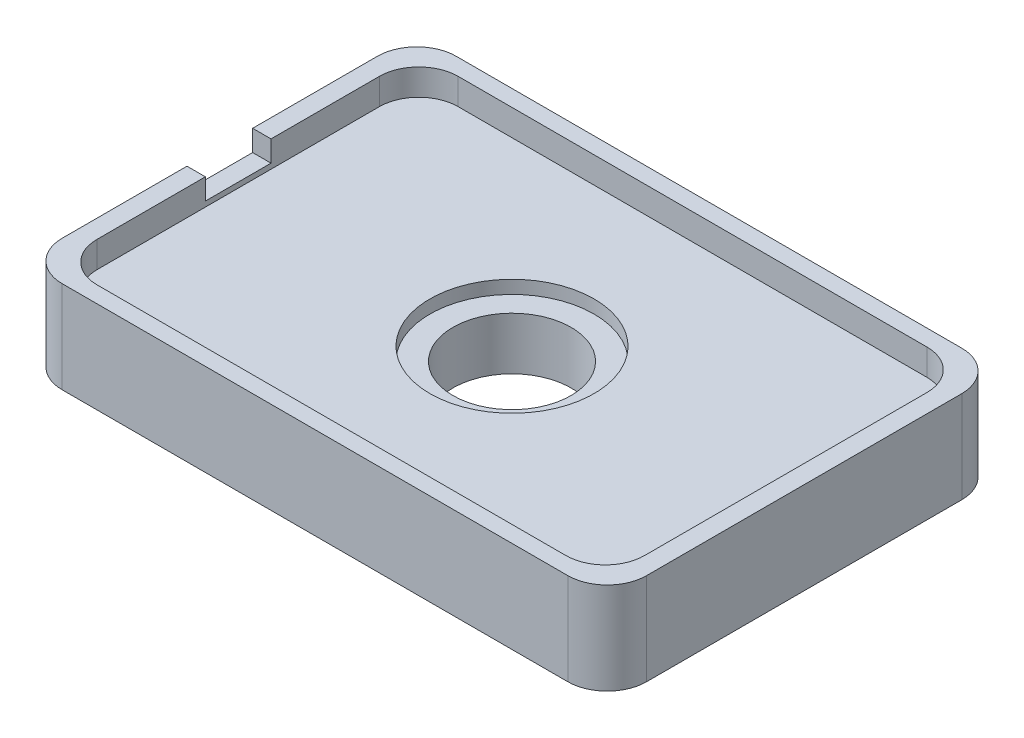
ISO-10303-21;
HEADER;
FILE_DESCRIPTION(('STEP AP214'),'2;1');
FILE_NAME('part.step','',(''),(''),'','','');
FILE_SCHEMA(('AUTOMOTIVE_DESIGN { 1 0 10303 214 1 1 1 1 }'));
ENDSEC;
DATA;
#1=APPLICATION_CONTEXT('core data for automotive mechanical design processes');
#2=APPLICATION_PROTOCOL_DEFINITION('international standard','automotive_design',2000,#1);
#3=PRODUCT_CONTEXT('',#1,'mechanical');
#4=PRODUCT('Part','Part','',(#3));
#5=PRODUCT_RELATED_PRODUCT_CATEGORY('part','',(#4));
#6=PRODUCT_DEFINITION_FORMATION('','',#4);
#7=PRODUCT_DEFINITION_CONTEXT('part definition',#1,'design');
#8=PRODUCT_DEFINITION('design','',#6,#7);
#9=PRODUCT_DEFINITION_SHAPE('','',#8);
#10=(LENGTH_UNIT() NAMED_UNIT(*) SI_UNIT(.MILLI.,.METRE.));
#11=(NAMED_UNIT(*) PLANE_ANGLE_UNIT() SI_UNIT($,.RADIAN.));
#12=(NAMED_UNIT(*) SI_UNIT($,.STERADIAN.) SOLID_ANGLE_UNIT());
#13=UNCERTAINTY_MEASURE_WITH_UNIT(LENGTH_MEASURE(1.E-05),#10,'distance_accuracy_value','');
#14=(GEOMETRIC_REPRESENTATION_CONTEXT(3) GLOBAL_UNCERTAINTY_ASSIGNED_CONTEXT((#13)) GLOBAL_UNIT_ASSIGNED_CONTEXT((#10,
#11,#12)) REPRESENTATION_CONTEXT('',''));
#15=CARTESIAN_POINT('',(0.,0.,0.));
#16=DIRECTION('',(0.,0.,1.));
#17=DIRECTION('',(1.,0.,0.));
#18=AXIS2_PLACEMENT_3D('',#15,#16,#17);
#19=CARTESIAN_POINT('',(0.,-5.001,0.));
#20=DIRECTION('',(0.,1.,0.));
#21=DIRECTION('',(0.,0.,1.));
#22=AXIS2_PLACEMENT_3D('',#19,#20,#21);
#23=CYLINDRICAL_SURFACE('',#22,4.5);
#24=CARTESIAN_POINT('',(0.,-5.,0.));
#25=DIRECTION('',(0.,1.,0.));
#26=DIRECTION('',(0.,0.,1.));
#27=AXIS2_PLACEMENT_3D('',#24,#25,#26);
#28=CIRCLE('',#27,4.5);
#29=CARTESIAN_POINT('',(0.,-5.,4.5));
#30=VERTEX_POINT('',#29);
#31=EDGE_CURVE('E244',#30,#30,#28,.F.);
#32=ORIENTED_EDGE('',*,*,#31,.T.);
#33=EDGE_LOOP('',(#32));
#34=FACE_BOUND('',#33,.T.);
#35=CARTESIAN_POINT('',(0.,-1.,0.));
#36=DIRECTION('',(0.,1.,0.));
#37=DIRECTION('',(0.,0.,1.));
#38=AXIS2_PLACEMENT_3D('',#35,#36,#37);
#39=CIRCLE('',#38,4.5);
#40=CARTESIAN_POINT('',(0.,-1.,4.5));
#41=VERTEX_POINT('',#40);
#42=EDGE_CURVE('E38',#41,#41,#39,.F.);
#43=ORIENTED_EDGE('',*,*,#42,.F.);
#44=EDGE_LOOP('',(#43));
#45=FACE_BOUND('',#44,.T.);
#46=ADVANCED_FACE('F34',(#34,#45),#23,.F.);
#47=CARTESIAN_POINT('',(22.25,-5.,-15.));
#48=DIRECTION('',(1.,0.,0.));
#49=DIRECTION('',(0.,0.,-1.));
#50=AXIS2_PLACEMENT_3D('',#47,#48,#49);
#51=PLANE('',#50);
#52=DIRECTION('',(0.,0.,-1.));
#53=VECTOR('',#52,1.);
#54=CARTESIAN_POINT('',(22.25,2.,15.));
#55=LINE('',#54,#53);
#56=CARTESIAN_POINT('',(22.25,2.,12.));
#57=VERTEX_POINT('',#56);
#58=CARTESIAN_POINT('',(22.25,2.,-12.));
#59=VERTEX_POINT('',#58);
#60=EDGE_CURVE('E237',#57,#59,#55,.T.);
#61=ORIENTED_EDGE('',*,*,#60,.F.);
#62=DIRECTION('',(0.,1.,0.));
#63=VECTOR('',#62,1.);
#64=CARTESIAN_POINT('',(22.25,-5.,12.));
#65=LINE('',#64,#63);
#66=CARTESIAN_POINT('',(22.25,-5.,12.));
#67=VERTEX_POINT('',#66);
#68=EDGE_CURVE('E317',#57,#67,#65,.F.);
#69=ORIENTED_EDGE('',*,*,#68,.T.);
#70=DIRECTION('',(0.,0.,-1.));
#71=VECTOR('',#70,1.);
#72=CARTESIAN_POINT('',(22.25,-5.,-15.));
#73=LINE('',#72,#71);
#74=CARTESIAN_POINT('',(22.25,-5.,-12.));
#75=VERTEX_POINT('',#74);
#76=EDGE_CURVE('E247',#67,#75,#73,.T.);
#77=ORIENTED_EDGE('',*,*,#76,.T.);
#78=DIRECTION('',(0.,1.,0.));
#79=VECTOR('',#78,1.);
#80=CARTESIAN_POINT('',(22.25,-5.,-12.));
#81=LINE('',#80,#79);
#82=EDGE_CURVE('E314',#75,#59,#81,.T.);
#83=ORIENTED_EDGE('',*,*,#82,.T.);
#84=EDGE_LOOP('',(#61,#69,#77,#83));
#85=FACE_BOUND('',#84,.T.);
#86=ADVANCED_FACE('F367',(#85),#51,.T.);
#87=CARTESIAN_POINT('',(-22.25,-5.,15.));
#88=DIRECTION('',(0.,0.,1.));
#89=DIRECTION('',(1.,0.,0.));
#90=AXIS2_PLACEMENT_3D('',#87,#88,#89);
#91=PLANE('',#90);
#92=DIRECTION('',(1.,0.,0.));
#93=VECTOR('',#92,1.);
#94=CARTESIAN_POINT('',(-22.25,2.,15.));
#95=LINE('',#94,#93);
#96=CARTESIAN_POINT('',(-19.25,2.,15.));
#97=VERTEX_POINT('',#96);
#98=CARTESIAN_POINT('',(19.25,2.,15.));
#99=VERTEX_POINT('',#98);
#100=EDGE_CURVE('E221',#97,#99,#95,.T.);
#101=ORIENTED_EDGE('',*,*,#100,.F.);
#102=DIRECTION('',(0.,1.,0.));
#103=VECTOR('',#102,1.);
#104=CARTESIAN_POINT('',(-19.25,-5.,15.));
#105=LINE('',#104,#103);
#106=CARTESIAN_POINT('',(-19.25,-5.,15.));
#107=VERTEX_POINT('',#106);
#108=EDGE_CURVE('E57',#97,#107,#105,.F.);
#109=ORIENTED_EDGE('',*,*,#108,.T.);
#110=DIRECTION('',(1.,0.,0.));
#111=VECTOR('',#110,1.);
#112=CARTESIAN_POINT('',(-22.25,-5.,15.));
#113=LINE('',#112,#111);
#114=CARTESIAN_POINT('',(19.25,-5.,15.));
#115=VERTEX_POINT('',#114);
#116=EDGE_CURVE('E256',#107,#115,#113,.T.);
#117=ORIENTED_EDGE('',*,*,#116,.T.);
#118=DIRECTION('',(0.,1.,0.));
#119=VECTOR('',#118,1.);
#120=CARTESIAN_POINT('',(19.25,-5.,15.));
#121=LINE('',#120,#119);
#122=EDGE_CURVE('E310',#115,#99,#121,.T.);
#123=ORIENTED_EDGE('',*,*,#122,.T.);
#124=EDGE_LOOP('',(#101,#109,#117,#123));
#125=FACE_BOUND('',#124,.T.);
#126=ADVANCED_FACE('F373',(#125),#91,.T.);
#127=CARTESIAN_POINT('',(-22.25,-5.,-15.));
#128=DIRECTION('',(-1.,0.,0.));
#129=DIRECTION('',(0.,0.,1.));
#130=AXIS2_PLACEMENT_3D('',#127,#128,#129);
#131=PLANE('',#130);
#132=DIRECTION('',(0.,0.,1.));
#133=VECTOR('',#132,1.);
#134=CARTESIAN_POINT('',(-22.25,2.,-15.));
#135=LINE('',#134,#133);
#136=CARTESIAN_POINT('',(-22.25,2.,-12.));
#137=VERTEX_POINT('',#136);
#138=CARTESIAN_POINT('',(-22.25,2.,-2.5));
#139=VERTEX_POINT('',#138);
#140=EDGE_CURVE('E200',#137,#139,#135,.T.);
#141=ORIENTED_EDGE('',*,*,#140,.F.);
#142=DIRECTION('',(0.,1.,0.));
#143=VECTOR('',#142,1.);
#144=CARTESIAN_POINT('',(-22.25,-5.,-12.));
#145=LINE('',#144,#143);
#146=CARTESIAN_POINT('',(-22.25,-5.,-12.));
#147=VERTEX_POINT('',#146);
#148=EDGE_CURVE('E301',#137,#147,#145,.F.);
#149=ORIENTED_EDGE('',*,*,#148,.T.);
#150=DIRECTION('',(0.,0.,1.));
#151=VECTOR('',#150,1.);
#152=CARTESIAN_POINT('',(-22.25,-5.,-15.));
#153=LINE('',#152,#151);
#154=CARTESIAN_POINT('',(-22.25,-5.,12.));
#155=VERTEX_POINT('',#154);
#156=EDGE_CURVE('E253',#147,#155,#153,.T.);
#157=ORIENTED_EDGE('',*,*,#156,.T.);
#158=DIRECTION('',(0.,1.,0.));
#159=VECTOR('',#158,1.);
#160=CARTESIAN_POINT('',(-22.25,-5.,12.));
#161=LINE('',#160,#159);
#162=CARTESIAN_POINT('',(-22.25,2.,12.));
#163=VERTEX_POINT('',#162);
#164=EDGE_CURVE('E298',#155,#163,#161,.T.);
#165=ORIENTED_EDGE('',*,*,#164,.T.);
#166=CARTESIAN_POINT('',(-22.25,2.,2.5));
#167=VERTEX_POINT('',#166);
#168=EDGE_CURVE('E242',#167,#163,#135,.T.);
#169=ORIENTED_EDGE('',*,*,#168,.F.);
#170=DIRECTION('',(0.,1.,0.));
#171=VECTOR('',#170,1.);
#172=CARTESIAN_POINT('',(-22.25,2.,2.5));
#173=LINE('',#172,#171);
#174=CARTESIAN_POINT('',(-22.25,0.4,2.5));
#175=VERTEX_POINT('',#174);
#176=EDGE_CURVE('E201',#175,#167,#173,.T.);
#177=ORIENTED_EDGE('',*,*,#176,.F.);
#178=DIRECTION('',(0.,0.,1.));
#179=VECTOR('',#178,1.);
#180=CARTESIAN_POINT('',(-22.25,0.4,2.5));
#181=LINE('',#180,#179);
#182=CARTESIAN_POINT('',(-22.25,0.4,-2.5));
#183=VERTEX_POINT('',#182);
#184=EDGE_CURVE('E226',#183,#175,#181,.T.);
#185=ORIENTED_EDGE('',*,*,#184,.F.);
#186=DIRECTION('',(0.,-1.,0.));
#187=VECTOR('',#186,1.);
#188=CARTESIAN_POINT('',(-22.25,2.,-2.5));
#189=LINE('',#188,#187);
#190=EDGE_CURVE('E203',#139,#183,#189,.T.);
#191=ORIENTED_EDGE('',*,*,#190,.F.);
#192=EDGE_LOOP('',(#141,#149,#157,#165,#169,#177,#185,#191));
#193=FACE_BOUND('',#192,.T.);
#194=ADVANCED_FACE('F390',(#193),#131,.T.);
#195=CARTESIAN_POINT('',(-22.25,-5.,-15.));
#196=DIRECTION('',(0.,0.,-1.));
#197=DIRECTION('',(-1.,0.,0.));
#198=AXIS2_PLACEMENT_3D('',#195,#196,#197);
#199=PLANE('',#198);
#200=DIRECTION('',(-1.,0.,0.));
#201=VECTOR('',#200,1.);
#202=CARTESIAN_POINT('',(-22.25,-5.,-15.));
#203=LINE('',#202,#201);
#204=CARTESIAN_POINT('',(19.25,-5.,-15.));
#205=VERTEX_POINT('',#204);
#206=CARTESIAN_POINT('',(-19.25,-5.,-15.));
#207=VERTEX_POINT('',#206);
#208=EDGE_CURVE('E250',#205,#207,#203,.T.);
#209=ORIENTED_EDGE('',*,*,#208,.T.);
#210=DIRECTION('',(0.,1.,0.));
#211=VECTOR('',#210,1.);
#212=CARTESIAN_POINT('',(-19.25,-5.,-15.));
#213=LINE('',#212,#211);
#214=CARTESIAN_POINT('',(-19.25,2.,-15.));
#215=VERTEX_POINT('',#214);
#216=EDGE_CURVE('E287',#207,#215,#213,.T.);
#217=ORIENTED_EDGE('',*,*,#216,.T.);
#218=DIRECTION('',(-1.,0.,0.));
#219=VECTOR('',#218,1.);
#220=CARTESIAN_POINT('',(22.25,2.,-15.));
#221=LINE('',#220,#219);
#222=CARTESIAN_POINT('',(19.25,2.,-15.));
#223=VERTEX_POINT('',#222);
#224=EDGE_CURVE('E240',#223,#215,#221,.T.);
#225=ORIENTED_EDGE('',*,*,#224,.F.);
#226=DIRECTION('',(0.,1.,0.));
#227=VECTOR('',#226,1.);
#228=CARTESIAN_POINT('',(19.25,-5.,-15.));
#229=LINE('',#228,#227);
#230=EDGE_CURVE('E285',#223,#205,#229,.F.);
#231=ORIENTED_EDGE('',*,*,#230,.T.);
#232=EDGE_LOOP('',(#209,#217,#225,#231));
#233=FACE_BOUND('',#232,.T.);
#234=ADVANCED_FACE('F383',(#233),#199,.T.);
#235=CARTESIAN_POINT('',(0.,-5.,0.));
#236=DIRECTION('',(0.,1.,0.));
#237=DIRECTION('',(0.,0.,1.));
#238=AXIS2_PLACEMENT_3D('',#235,#236,#237);
#239=PLANE('',#238);
#240=ORIENTED_EDGE('',*,*,#31,.F.);
#241=EDGE_LOOP('',(#240));
#242=FACE_BOUND('',#241,.T.);
#243=ORIENTED_EDGE('',*,*,#156,.F.);
#244=CARTESIAN_POINT('',(-19.25,-5.,-12.));
#245=DIRECTION('',(0.,1.,0.));
#246=DIRECTION('',(0.,0.,1.));
#247=AXIS2_PLACEMENT_3D('',#244,#245,#246);
#248=CIRCLE('',#247,3.);
#249=EDGE_CURVE('E308',#147,#207,#248,.F.);
#250=ORIENTED_EDGE('',*,*,#249,.T.);
#251=ORIENTED_EDGE('',*,*,#208,.F.);
#252=CARTESIAN_POINT('',(19.25,-5.,-12.));
#253=DIRECTION('',(0.,1.,0.));
#254=DIRECTION('',(0.,0.,1.));
#255=AXIS2_PLACEMENT_3D('',#252,#253,#254);
#256=CIRCLE('',#255,3.);
#257=EDGE_CURVE('E303',#205,#75,#256,.F.);
#258=ORIENTED_EDGE('',*,*,#257,.T.);
#259=ORIENTED_EDGE('',*,*,#76,.F.);
#260=CARTESIAN_POINT('',(19.25,-5.,12.));
#261=DIRECTION('',(0.,1.,0.));
#262=DIRECTION('',(0.,0.,1.));
#263=AXIS2_PLACEMENT_3D('',#260,#261,#262);
#264=CIRCLE('',#263,3.);
#265=EDGE_CURVE('E50',#67,#115,#264,.F.);
#266=ORIENTED_EDGE('',*,*,#265,.T.);
#267=ORIENTED_EDGE('',*,*,#116,.F.);
#268=CARTESIAN_POINT('',(-19.25,-5.,12.));
#269=DIRECTION('',(0.,1.,0.));
#270=DIRECTION('',(0.,0.,1.));
#271=AXIS2_PLACEMENT_3D('',#268,#269,#270);
#272=CIRCLE('',#271,3.);
#273=EDGE_CURVE('E306',#107,#155,#272,.F.);
#274=ORIENTED_EDGE('',*,*,#273,.T.);
#275=EDGE_LOOP('',(#243,#250,#251,#258,#259,#266,#267,#274));
#276=FACE_BOUND('',#275,.T.);
#277=ADVANCED_FACE('F380',(#242,#276),#239,.F.);
#278=CARTESIAN_POINT('',(0.,0.,0.));
#279=DIRECTION('',(0.,1.,0.));
#280=DIRECTION('',(0.,0.,1.));
#281=AXIS2_PLACEMENT_3D('',#278,#279,#280);
#282=PLANE('',#281);
#283=CARTESIAN_POINT('',(0.,0.,0.));
#284=DIRECTION('',(0.,1.,0.));
#285=DIRECTION('',(0.,0.,1.));
#286=AXIS2_PLACEMENT_3D('',#283,#284,#285);
#287=CIRCLE('',#286,6.25);
#288=CARTESIAN_POINT('',(0.,0.,6.25));
#289=VERTEX_POINT('',#288);
#290=EDGE_CURVE('E626',#289,#289,#287,.T.);
#291=ORIENTED_EDGE('',*,*,#290,.F.);
#292=EDGE_LOOP('',(#291));
#293=FACE_BOUND('',#292,.T.);
#294=DIRECTION('',(0.,0.,-1.));
#295=VECTOR('',#294,1.);
#296=CARTESIAN_POINT('',(20.85,0.,13.75));
#297=LINE('',#296,#295);
#298=CARTESIAN_POINT('',(20.85,0.,10.75));
#299=VERTEX_POINT('',#298);
#300=CARTESIAN_POINT('',(20.85,0.,-10.75));
#301=VERTEX_POINT('',#300);
#302=EDGE_CURVE('E229',#299,#301,#297,.T.);
#303=ORIENTED_EDGE('',*,*,#302,.T.);
#304=CARTESIAN_POINT('',(17.85,0.,-10.75));
#305=DIRECTION('',(0.,1.,0.));
#306=DIRECTION('',(0.,0.,1.));
#307=AXIS2_PLACEMENT_3D('',#304,#305,#306);
#308=CIRCLE('',#307,3.);
#309=CARTESIAN_POINT('',(17.85,0.,-13.75));
#310=VERTEX_POINT('',#309);
#311=EDGE_CURVE('E269',#301,#310,#308,.T.);
#312=ORIENTED_EDGE('',*,*,#311,.T.);
#313=DIRECTION('',(-1.,0.,0.));
#314=VECTOR('',#313,1.);
#315=CARTESIAN_POINT('',(20.85,0.,-13.75));
#316=LINE('',#315,#314);
#317=CARTESIAN_POINT('',(-17.85,0.,-13.75));
#318=VERTEX_POINT('',#317);
#319=EDGE_CURVE('E232',#310,#318,#316,.T.);
#320=ORIENTED_EDGE('',*,*,#319,.T.);
#321=CARTESIAN_POINT('',(-17.85,0.,-10.75));
#322=DIRECTION('',(0.,1.,0.));
#323=DIRECTION('',(0.,0.,1.));
#324=AXIS2_PLACEMENT_3D('',#321,#322,#323);
#325=CIRCLE('',#324,3.);
#326=CARTESIAN_POINT('',(-20.85,0.,-10.75));
#327=VERTEX_POINT('',#326);
#328=EDGE_CURVE('E267',#318,#327,#325,.T.);
#329=ORIENTED_EDGE('',*,*,#328,.T.);
#330=DIRECTION('',(0.,0.,1.));
#331=VECTOR('',#330,1.);
#332=CARTESIAN_POINT('',(-20.85,0.,13.75));
#333=LINE('',#332,#331);
#334=CARTESIAN_POINT('',(-20.85,0.,10.75));
#335=VERTEX_POINT('',#334);
#336=EDGE_CURVE('E222',#327,#335,#333,.T.);
#337=ORIENTED_EDGE('',*,*,#336,.T.);
#338=CARTESIAN_POINT('',(-17.85,0.,10.75));
#339=DIRECTION('',(0.,1.,0.));
#340=DIRECTION('',(0.,0.,1.));
#341=AXIS2_PLACEMENT_3D('',#338,#339,#340);
#342=CIRCLE('',#341,3.);
#343=CARTESIAN_POINT('',(-17.85,0.,13.75));
#344=VERTEX_POINT('',#343);
#345=EDGE_CURVE('E265',#335,#344,#342,.T.);
#346=ORIENTED_EDGE('',*,*,#345,.T.);
#347=DIRECTION('',(1.,0.,0.));
#348=VECTOR('',#347,1.);
#349=CARTESIAN_POINT('',(20.85,0.,13.75));
#350=LINE('',#349,#348);
#351=CARTESIAN_POINT('',(17.85,0.,13.75));
#352=VERTEX_POINT('',#351);
#353=EDGE_CURVE('E225',#344,#352,#350,.T.);
#354=ORIENTED_EDGE('',*,*,#353,.T.);
#355=CARTESIAN_POINT('',(17.85,0.,10.75));
#356=DIRECTION('',(0.,1.,0.));
#357=DIRECTION('',(0.,0.,1.));
#358=AXIS2_PLACEMENT_3D('',#355,#356,#357);
#359=CIRCLE('',#358,3.);
#360=EDGE_CURVE('E263',#352,#299,#359,.T.);
#361=ORIENTED_EDGE('',*,*,#360,.T.);
#362=EDGE_LOOP('',(#303,#312,#320,#329,#337,#346,#354,#361));
#363=FACE_BOUND('',#362,.T.);
#364=ADVANCED_FACE('F334',(#293,#363),#282,.T.);
#365=CARTESIAN_POINT('',(0.,2.,0.));
#366=DIRECTION('',(0.,1.,0.));
#367=DIRECTION('',(0.,0.,1.));
#368=AXIS2_PLACEMENT_3D('',#365,#366,#367);
#369=PLANE('',#368);
#370=ORIENTED_EDGE('',*,*,#224,.T.);
#371=CARTESIAN_POINT('',(-19.25,2.,-12.));
#372=DIRECTION('',(0.,1.,0.));
#373=DIRECTION('',(0.,0.,1.));
#374=AXIS2_PLACEMENT_3D('',#371,#372,#373);
#375=CIRCLE('',#374,3.);
#376=EDGE_CURVE('E296',#215,#137,#375,.T.);
#377=ORIENTED_EDGE('',*,*,#376,.T.);
#378=ORIENTED_EDGE('',*,*,#140,.T.);
#379=DIRECTION('',(-1.,0.,0.));
#380=VECTOR('',#379,1.);
#381=CARTESIAN_POINT('',(22.251,2.,-2.5));
#382=LINE('',#381,#380);
#383=CARTESIAN_POINT('',(-20.85,2.,-2.5));
#384=VERTEX_POINT('',#383);
#385=EDGE_CURVE('E191',#384,#139,#382,.T.);
#386=ORIENTED_EDGE('',*,*,#385,.F.);
#387=DIRECTION('',(0.,0.,1.));
#388=VECTOR('',#387,1.);
#389=CARTESIAN_POINT('',(-20.85,2.,13.75));
#390=LINE('',#389,#388);
#391=CARTESIAN_POINT('',(-20.85,2.,-10.75));
#392=VERTEX_POINT('',#391);
#393=EDGE_CURVE('E173',#392,#384,#390,.T.);
#394=ORIENTED_EDGE('',*,*,#393,.F.);
#395=CARTESIAN_POINT('',(-17.85,2.,-10.75));
#396=DIRECTION('',(0.,1.,0.));
#397=DIRECTION('',(0.,0.,1.));
#398=AXIS2_PLACEMENT_3D('',#395,#396,#397);
#399=CIRCLE('',#398,3.);
#400=CARTESIAN_POINT('',(-17.85,2.,-13.75));
#401=VERTEX_POINT('',#400);
#402=EDGE_CURVE('E321',#392,#401,#399,.F.);
#403=ORIENTED_EDGE('',*,*,#402,.T.);
#404=DIRECTION('',(-1.,0.,0.));
#405=VECTOR('',#404,1.);
#406=CARTESIAN_POINT('',(20.85,2.,-13.75));
#407=LINE('',#406,#405);
#408=CARTESIAN_POINT('',(17.85,2.,-13.75));
#409=VERTEX_POINT('',#408);
#410=EDGE_CURVE('E218',#409,#401,#407,.T.);
#411=ORIENTED_EDGE('',*,*,#410,.F.);
#412=CARTESIAN_POINT('',(17.85,2.,-10.75));
#413=DIRECTION('',(0.,1.,0.));
#414=DIRECTION('',(0.,0.,1.));
#415=AXIS2_PLACEMENT_3D('',#412,#413,#414);
#416=CIRCLE('',#415,3.);
#417=CARTESIAN_POINT('',(20.85,2.,-10.75));
#418=VERTEX_POINT('',#417);
#419=EDGE_CURVE('E319',#409,#418,#416,.F.);
#420=ORIENTED_EDGE('',*,*,#419,.T.);
#421=DIRECTION('',(0.,0.,-1.));
#422=VECTOR('',#421,1.);
#423=CARTESIAN_POINT('',(20.85,2.,13.75));
#424=LINE('',#423,#422);
#425=CARTESIAN_POINT('',(20.85,2.,10.75));
#426=VERTEX_POINT('',#425);
#427=EDGE_CURVE('E215',#426,#418,#424,.T.);
#428=ORIENTED_EDGE('',*,*,#427,.F.);
#429=CARTESIAN_POINT('',(17.85,2.,10.75));
#430=DIRECTION('',(0.,1.,0.));
#431=DIRECTION('',(0.,0.,1.));
#432=AXIS2_PLACEMENT_3D('',#429,#430,#431);
#433=CIRCLE('',#432,3.);
#434=CARTESIAN_POINT('',(17.85,2.,13.75));
#435=VERTEX_POINT('',#434);
#436=EDGE_CURVE('E11',#426,#435,#433,.F.);
#437=ORIENTED_EDGE('',*,*,#436,.T.);
#438=DIRECTION('',(1.,0.,0.));
#439=VECTOR('',#438,1.);
#440=CARTESIAN_POINT('',(20.85,2.,13.75));
#441=LINE('',#440,#439);
#442=CARTESIAN_POINT('',(-17.85,2.,13.75));
#443=VERTEX_POINT('',#442);
#444=EDGE_CURVE('E184',#443,#435,#441,.T.);
#445=ORIENTED_EDGE('',*,*,#444,.F.);
#446=CARTESIAN_POINT('',(-17.85,2.,10.75));
#447=DIRECTION('',(0.,1.,0.));
#448=DIRECTION('',(0.,0.,1.));
#449=AXIS2_PLACEMENT_3D('',#446,#447,#448);
#450=CIRCLE('',#449,3.);
#451=CARTESIAN_POINT('',(-20.85,2.,10.75));
#452=VERTEX_POINT('',#451);
#453=EDGE_CURVE('E43',#443,#452,#450,.F.);
#454=ORIENTED_EDGE('',*,*,#453,.T.);
#455=CARTESIAN_POINT('',(-20.85,2.,2.5));
#456=VERTEX_POINT('',#455);
#457=EDGE_CURVE('E185',#456,#452,#390,.T.);
#458=ORIENTED_EDGE('',*,*,#457,.F.);
#459=DIRECTION('',(-1.,0.,0.));
#460=VECTOR('',#459,1.);
#461=CARTESIAN_POINT('',(22.251,2.,2.5));
#462=LINE('',#461,#460);
#463=EDGE_CURVE('E208',#456,#167,#462,.T.);
#464=ORIENTED_EDGE('',*,*,#463,.T.);
#465=ORIENTED_EDGE('',*,*,#168,.T.);
#466=CARTESIAN_POINT('',(-19.25,2.,12.));
#467=DIRECTION('',(0.,1.,0.));
#468=DIRECTION('',(0.,0.,1.));
#469=AXIS2_PLACEMENT_3D('',#466,#467,#468);
#470=CIRCLE('',#469,3.);
#471=EDGE_CURVE('E294',#163,#97,#470,.T.);
#472=ORIENTED_EDGE('',*,*,#471,.T.);
#473=ORIENTED_EDGE('',*,*,#100,.T.);
#474=CARTESIAN_POINT('',(19.25,2.,12.));
#475=DIRECTION('',(0.,1.,0.));
#476=DIRECTION('',(0.,0.,1.));
#477=AXIS2_PLACEMENT_3D('',#474,#475,#476);
#478=CIRCLE('',#477,3.);
#479=EDGE_CURVE('E292',#99,#57,#478,.T.);
#480=ORIENTED_EDGE('',*,*,#479,.T.);
#481=ORIENTED_EDGE('',*,*,#60,.T.);
#482=CARTESIAN_POINT('',(19.25,2.,-12.));
#483=DIRECTION('',(0.,1.,0.));
#484=DIRECTION('',(0.,0.,1.));
#485=AXIS2_PLACEMENT_3D('',#482,#483,#484);
#486=CIRCLE('',#485,3.);
#487=EDGE_CURVE('E290',#59,#223,#486,.T.);
#488=ORIENTED_EDGE('',*,*,#487,.T.);
#489=EDGE_LOOP('',(#370,#377,#378,#386,#394,#403,#411,#420,#428,#437,#445,#454,#458,#464,#465,
#472,#473,#480,#481,#488));
#490=FACE_BOUND('',#489,.T.);
#491=ADVANCED_FACE('F198',(#490),#369,.T.);
#492=CARTESIAN_POINT('',(-20.85,2.,13.75));
#493=DIRECTION('',(1.,0.,0.));
#494=DIRECTION('',(0.,0.,-1.));
#495=AXIS2_PLACEMENT_3D('',#492,#493,#494);
#496=PLANE('',#495);
#497=ORIENTED_EDGE('',*,*,#336,.F.);
#498=DIRECTION('',(0.,-1.,0.));
#499=VECTOR('',#498,1.);
#500=CARTESIAN_POINT('',(-20.85,2.,-10.75));
#501=LINE('',#500,#499);
#502=EDGE_CURVE('E180',#327,#392,#501,.F.);
#503=ORIENTED_EDGE('',*,*,#502,.T.);
#504=ORIENTED_EDGE('',*,*,#393,.T.);
#505=DIRECTION('',(0.,-1.,0.));
#506=VECTOR('',#505,1.);
#507=CARTESIAN_POINT('',(-20.85,2.,-2.5));
#508=LINE('',#507,#506);
#509=CARTESIAN_POINT('',(-20.85,0.4,-2.5));
#510=VERTEX_POINT('',#509);
#511=EDGE_CURVE('E178',#384,#510,#508,.T.);
#512=ORIENTED_EDGE('',*,*,#511,.T.);
#513=DIRECTION('',(0.,0.,1.));
#514=VECTOR('',#513,1.);
#515=CARTESIAN_POINT('',(-20.85,0.4,2.5));
#516=LINE('',#515,#514);
#517=CARTESIAN_POINT('',(-20.85,0.4,2.5));
#518=VERTEX_POINT('',#517);
#519=EDGE_CURVE('E210',#510,#518,#516,.T.);
#520=ORIENTED_EDGE('',*,*,#519,.T.);
#521=DIRECTION('',(0.,1.,0.));
#522=VECTOR('',#521,1.);
#523=CARTESIAN_POINT('',(-20.85,2.,2.5));
#524=LINE('',#523,#522);
#525=EDGE_CURVE('E211',#518,#456,#524,.T.);
#526=ORIENTED_EDGE('',*,*,#525,.T.);
#527=ORIENTED_EDGE('',*,*,#457,.T.);
#528=DIRECTION('',(0.,-1.,0.));
#529=VECTOR('',#528,1.);
#530=CARTESIAN_POINT('',(-20.85,0.,10.75));
#531=LINE('',#530,#529);
#532=EDGE_CURVE('E276',#452,#335,#531,.T.);
#533=ORIENTED_EDGE('',*,*,#532,.T.);
#534=EDGE_LOOP('',(#497,#503,#504,#512,#520,#526,#527,#533));
#535=FACE_BOUND('',#534,.T.);
#536=ADVANCED_FACE('F176',(#535),#496,.T.);
#537=CARTESIAN_POINT('',(20.85,2.,13.75));
#538=DIRECTION('',(0.,0.,-1.));
#539=DIRECTION('',(-1.,0.,0.));
#540=AXIS2_PLACEMENT_3D('',#537,#538,#539);
#541=PLANE('',#540);
#542=ORIENTED_EDGE('',*,*,#353,.F.);
#543=DIRECTION('',(0.,-1.,0.));
#544=VECTOR('',#543,1.);
#545=CARTESIAN_POINT('',(-17.85,2.,13.75));
#546=LINE('',#545,#544);
#547=EDGE_CURVE('E283',#344,#443,#546,.F.);
#548=ORIENTED_EDGE('',*,*,#547,.T.);
#549=ORIENTED_EDGE('',*,*,#444,.T.);
#550=DIRECTION('',(0.,-1.,0.));
#551=VECTOR('',#550,1.);
#552=CARTESIAN_POINT('',(17.85,0.,13.75));
#553=LINE('',#552,#551);
#554=EDGE_CURVE('E280',#435,#352,#553,.T.);
#555=ORIENTED_EDGE('',*,*,#554,.T.);
#556=EDGE_LOOP('',(#542,#548,#549,#555));
#557=FACE_BOUND('',#556,.T.);
#558=ADVANCED_FACE('F336',(#557),#541,.T.);
#559=CARTESIAN_POINT('',(20.85,2.,13.75));
#560=DIRECTION('',(-1.,0.,0.));
#561=DIRECTION('',(0.,0.,1.));
#562=AXIS2_PLACEMENT_3D('',#559,#560,#561);
#563=PLANE('',#562);
#564=ORIENTED_EDGE('',*,*,#427,.T.);
#565=DIRECTION('',(0.,-1.,0.));
#566=VECTOR('',#565,1.);
#567=CARTESIAN_POINT('',(20.85,0.,-10.75));
#568=LINE('',#567,#566);
#569=EDGE_CURVE('E260',#418,#301,#568,.T.);
#570=ORIENTED_EDGE('',*,*,#569,.T.);
#571=ORIENTED_EDGE('',*,*,#302,.F.);
#572=DIRECTION('',(0.,-1.,0.));
#573=VECTOR('',#572,1.);
#574=CARTESIAN_POINT('',(20.85,2.,10.75));
#575=LINE('',#574,#573);
#576=EDGE_CURVE('E258',#299,#426,#575,.F.);
#577=ORIENTED_EDGE('',*,*,#576,.T.);
#578=EDGE_LOOP('',(#564,#570,#571,#577));
#579=FACE_BOUND('',#578,.T.);
#580=ADVANCED_FACE('F344',(#579),#563,.T.);
#581=CARTESIAN_POINT('',(20.85,2.,-13.75));
#582=DIRECTION('',(0.,0.,1.));
#583=DIRECTION('',(1.,0.,0.));
#584=AXIS2_PLACEMENT_3D('',#581,#582,#583);
#585=PLANE('',#584);
#586=ORIENTED_EDGE('',*,*,#319,.F.);
#587=DIRECTION('',(0.,-1.,0.));
#588=VECTOR('',#587,1.);
#589=CARTESIAN_POINT('',(17.85,2.,-13.75));
#590=LINE('',#589,#588);
#591=EDGE_CURVE('E274',#310,#409,#590,.F.);
#592=ORIENTED_EDGE('',*,*,#591,.T.);
#593=ORIENTED_EDGE('',*,*,#410,.T.);
#594=DIRECTION('',(0.,-1.,0.));
#595=VECTOR('',#594,1.);
#596=CARTESIAN_POINT('',(-17.85,0.,-13.75));
#597=LINE('',#596,#595);
#598=EDGE_CURVE('E271',#401,#318,#597,.T.);
#599=ORIENTED_EDGE('',*,*,#598,.T.);
#600=EDGE_LOOP('',(#586,#592,#593,#599));
#601=FACE_BOUND('',#600,.T.);
#602=ADVANCED_FACE('F353',(#601),#585,.T.);
#603=CARTESIAN_POINT('',(22.251,2.,2.5));
#604=DIRECTION('',(0.,0.,1.));
#605=DIRECTION('',(0.,-1.,0.));
#606=AXIS2_PLACEMENT_3D('',#603,#604,#605);
#607=PLANE('',#606);
#608=DIRECTION('',(-1.,0.,0.));
#609=VECTOR('',#608,1.);
#610=CARTESIAN_POINT('',(22.251,0.4,2.5));
#611=LINE('',#610,#609);
#612=EDGE_CURVE('E195',#518,#175,#611,.T.);
#613=ORIENTED_EDGE('',*,*,#612,.T.);
#614=ORIENTED_EDGE('',*,*,#176,.T.);
#615=ORIENTED_EDGE('',*,*,#463,.F.);
#616=ORIENTED_EDGE('',*,*,#525,.F.);
#617=EDGE_LOOP('',(#613,#614,#615,#616));
#618=FACE_BOUND('',#617,.T.);
#619=ADVANCED_FACE('F418',(#618),#607,.F.);
#620=CARTESIAN_POINT('',(22.251,0.4,2.5));
#621=DIRECTION('',(0.,-1.,0.));
#622=DIRECTION('',(0.,0.,-1.));
#623=AXIS2_PLACEMENT_3D('',#620,#621,#622);
#624=PLANE('',#623);
#625=DIRECTION('',(-1.,0.,0.));
#626=VECTOR('',#625,1.);
#627=CARTESIAN_POINT('',(22.251,0.4,-2.5));
#628=LINE('',#627,#626);
#629=EDGE_CURVE('E193',#510,#183,#628,.T.);
#630=ORIENTED_EDGE('',*,*,#629,.T.);
#631=ORIENTED_EDGE('',*,*,#184,.T.);
#632=ORIENTED_EDGE('',*,*,#612,.F.);
#633=ORIENTED_EDGE('',*,*,#519,.F.);
#634=EDGE_LOOP('',(#630,#631,#632,#633));
#635=FACE_BOUND('',#634,.T.);
#636=ADVANCED_FACE('F420',(#635),#624,.F.);
#637=CARTESIAN_POINT('',(22.251,2.,-2.5));
#638=DIRECTION('',(0.,0.,-1.));
#639=DIRECTION('',(0.,1.,0.));
#640=AXIS2_PLACEMENT_3D('',#637,#638,#639);
#641=PLANE('',#640);
#642=ORIENTED_EDGE('',*,*,#385,.T.);
#643=ORIENTED_EDGE('',*,*,#190,.T.);
#644=ORIENTED_EDGE('',*,*,#629,.F.);
#645=ORIENTED_EDGE('',*,*,#511,.F.);
#646=EDGE_LOOP('',(#642,#643,#644,#645));
#647=FACE_BOUND('',#646,.T.);
#648=ADVANCED_FACE('F189',(#647),#641,.F.);
#649=CARTESIAN_POINT('',(17.85,2.,-10.75));
#650=DIRECTION('',(0.,1.,0.));
#651=DIRECTION('',(0.,0.,1.));
#652=AXIS2_PLACEMENT_3D('',#649,#650,#651);
#653=CYLINDRICAL_SURFACE('',#652,3.);
#654=ORIENTED_EDGE('',*,*,#419,.F.);
#655=ORIENTED_EDGE('',*,*,#591,.F.);
#656=ORIENTED_EDGE('',*,*,#311,.F.);
#657=ORIENTED_EDGE('',*,*,#569,.F.);
#658=EDGE_LOOP('',(#654,#655,#656,#657));
#659=FACE_BOUND('',#658,.T.);
#660=ADVANCED_FACE('F349',(#659),#653,.F.);
#661=CARTESIAN_POINT('',(-17.85,2.,-10.75));
#662=DIRECTION('',(0.,1.,0.));
#663=DIRECTION('',(0.,0.,1.));
#664=AXIS2_PLACEMENT_3D('',#661,#662,#663);
#665=CYLINDRICAL_SURFACE('',#664,3.);
#666=ORIENTED_EDGE('',*,*,#402,.F.);
#667=ORIENTED_EDGE('',*,*,#502,.F.);
#668=ORIENTED_EDGE('',*,*,#328,.F.);
#669=ORIENTED_EDGE('',*,*,#598,.F.);
#670=EDGE_LOOP('',(#666,#667,#668,#669));
#671=FACE_BOUND('',#670,.T.);
#672=ADVANCED_FACE('F357',(#671),#665,.F.);
#673=CARTESIAN_POINT('',(-17.85,2.,10.75));
#674=DIRECTION('',(0.,1.,0.));
#675=DIRECTION('',(0.,0.,1.));
#676=AXIS2_PLACEMENT_3D('',#673,#674,#675);
#677=CYLINDRICAL_SURFACE('',#676,3.);
#678=ORIENTED_EDGE('',*,*,#453,.F.);
#679=ORIENTED_EDGE('',*,*,#547,.F.);
#680=ORIENTED_EDGE('',*,*,#345,.F.);
#681=ORIENTED_EDGE('',*,*,#532,.F.);
#682=EDGE_LOOP('',(#678,#679,#680,#681));
#683=FACE_BOUND('',#682,.T.);
#684=ADVANCED_FACE('F331',(#683),#677,.F.);
#685=CARTESIAN_POINT('',(17.85,2.,10.75));
#686=DIRECTION('',(0.,1.,0.));
#687=DIRECTION('',(0.,0.,1.));
#688=AXIS2_PLACEMENT_3D('',#685,#686,#687);
#689=CYLINDRICAL_SURFACE('',#688,3.);
#690=ORIENTED_EDGE('',*,*,#436,.F.);
#691=ORIENTED_EDGE('',*,*,#576,.F.);
#692=ORIENTED_EDGE('',*,*,#360,.F.);
#693=ORIENTED_EDGE('',*,*,#554,.F.);
#694=EDGE_LOOP('',(#690,#691,#692,#693));
#695=FACE_BOUND('',#694,.T.);
#696=ADVANCED_FACE('F340',(#695),#689,.F.);
#697=CARTESIAN_POINT('',(-19.25,-5.,-12.));
#698=DIRECTION('',(0.,1.,0.));
#699=DIRECTION('',(0.,0.,1.));
#700=AXIS2_PLACEMENT_3D('',#697,#698,#699);
#701=CYLINDRICAL_SURFACE('',#700,3.);
#702=ORIENTED_EDGE('',*,*,#249,.F.);
#703=ORIENTED_EDGE('',*,*,#148,.F.);
#704=ORIENTED_EDGE('',*,*,#376,.F.);
#705=ORIENTED_EDGE('',*,*,#216,.F.);
#706=EDGE_LOOP('',(#702,#703,#704,#705));
#707=FACE_BOUND('',#706,.T.);
#708=ADVANCED_FACE('F405',(#707),#701,.T.);
#709=CARTESIAN_POINT('',(-19.25,-5.,12.));
#710=DIRECTION('',(0.,1.,0.));
#711=DIRECTION('',(0.,0.,1.));
#712=AXIS2_PLACEMENT_3D('',#709,#710,#711);
#713=CYLINDRICAL_SURFACE('',#712,3.);
#714=ORIENTED_EDGE('',*,*,#273,.F.);
#715=ORIENTED_EDGE('',*,*,#108,.F.);
#716=ORIENTED_EDGE('',*,*,#471,.F.);
#717=ORIENTED_EDGE('',*,*,#164,.F.);
#718=EDGE_LOOP('',(#714,#715,#716,#717));
#719=FACE_BOUND('',#718,.T.);
#720=ADVANCED_FACE('F427',(#719),#713,.T.);
#721=CARTESIAN_POINT('',(19.25,-5.,12.));
#722=DIRECTION('',(0.,1.,0.));
#723=DIRECTION('',(0.,0.,1.));
#724=AXIS2_PLACEMENT_3D('',#721,#722,#723);
#725=CYLINDRICAL_SURFACE('',#724,3.);
#726=ORIENTED_EDGE('',*,*,#265,.F.);
#727=ORIENTED_EDGE('',*,*,#68,.F.);
#728=ORIENTED_EDGE('',*,*,#479,.F.);
#729=ORIENTED_EDGE('',*,*,#122,.F.);
#730=EDGE_LOOP('',(#726,#727,#728,#729));
#731=FACE_BOUND('',#730,.T.);
#732=ADVANCED_FACE('F429',(#731),#725,.T.);
#733=CARTESIAN_POINT('',(19.25,-5.,-12.));
#734=DIRECTION('',(0.,1.,0.));
#735=DIRECTION('',(0.,0.,1.));
#736=AXIS2_PLACEMENT_3D('',#733,#734,#735);
#737=CYLINDRICAL_SURFACE('',#736,3.);
#738=ORIENTED_EDGE('',*,*,#257,.F.);
#739=ORIENTED_EDGE('',*,*,#230,.F.);
#740=ORIENTED_EDGE('',*,*,#487,.F.);
#741=ORIENTED_EDGE('',*,*,#82,.F.);
#742=EDGE_LOOP('',(#738,#739,#740,#741));
#743=FACE_BOUND('',#742,.T.);
#744=ADVANCED_FACE('F36',(#743),#737,.T.);
#745=CARTESIAN_POINT('',(0.,-1.,0.));
#746=DIRECTION('',(0.,1.,0.));
#747=DIRECTION('',(0.,0.,1.));
#748=AXIS2_PLACEMENT_3D('',#745,#746,#747);
#749=PLANE('',#748);
#750=CARTESIAN_POINT('',(0.,-1.,0.));
#751=DIRECTION('',(0.,1.,0.));
#752=DIRECTION('',(0.,0.,1.));
#753=AXIS2_PLACEMENT_3D('',#750,#751,#752);
#754=CIRCLE('',#753,6.25);
#755=CARTESIAN_POINT('',(0.,-1.,6.25));
#756=VERTEX_POINT('',#755);
#757=EDGE_CURVE('E623',#756,#756,#754,.T.);
#758=ORIENTED_EDGE('',*,*,#757,.T.);
#759=EDGE_LOOP('',(#758));
#760=FACE_BOUND('',#759,.T.);
#761=ORIENTED_EDGE('',*,*,#42,.T.);
#762=EDGE_LOOP('',(#761));
#763=FACE_BOUND('',#762,.T.);
#764=ADVANCED_FACE('F435',(#760,#763),#749,.T.);
#765=CARTESIAN_POINT('',(0.,-1.,0.));
#766=DIRECTION('',(0.,1.,0.));
#767=DIRECTION('',(0.,0.,1.));
#768=AXIS2_PLACEMENT_3D('',#765,#766,#767);
#769=CYLINDRICAL_SURFACE('',#768,6.25);
#770=ORIENTED_EDGE('',*,*,#757,.F.);
#771=EDGE_LOOP('',(#770));
#772=FACE_BOUND('',#771,.T.);
#773=ORIENTED_EDGE('',*,*,#290,.T.);
#774=EDGE_LOOP('',(#773));
#775=FACE_BOUND('',#774,.T.);
#776=ADVANCED_FACE('F440',(#772,#775),#769,.F.);
#777=CLOSED_SHELL('',(#46,#86,#126,#194,#234,#277,#364,#491,#536,#558,#580,#602,#619,#636,#648,
#660,#672,#684,#696,#708,#720,#732,#744,#764,#776));
#778=MANIFOLD_SOLID_BREP('B2',#777);
#779=ADVANCED_BREP_SHAPE_REPRESENTATION('',(#18,#778),#14);
#780=SHAPE_DEFINITION_REPRESENTATION(#9,#779);
ENDSEC;
END-ISO-10303-21;
